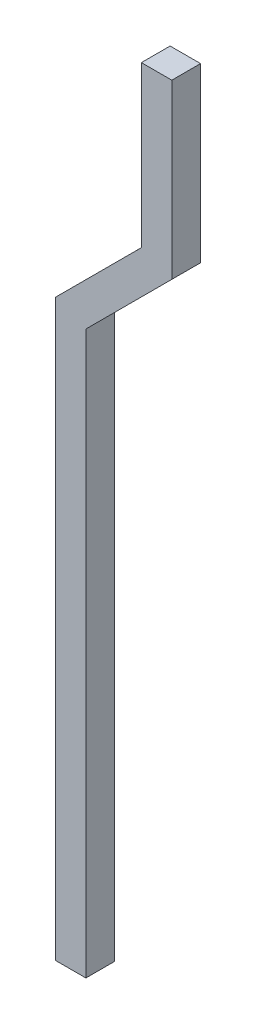
ISO-10303-21;
HEADER;
FILE_DESCRIPTION(('STEP AP214'),'2;1');
FILE_NAME('part.step','',(''),(''),'','','');
FILE_SCHEMA(('AUTOMOTIVE_DESIGN { 1 0 10303 214 1 1 1 1 }'));
ENDSEC;
DATA;
#1=APPLICATION_CONTEXT('core data for automotive mechanical design processes');
#2=APPLICATION_PROTOCOL_DEFINITION('international standard','automotive_design',2000,#1);
#3=PRODUCT_CONTEXT('',#1,'mechanical');
#4=PRODUCT('Part','Part','',(#3));
#5=PRODUCT_RELATED_PRODUCT_CATEGORY('part','',(#4));
#6=PRODUCT_DEFINITION_FORMATION('','',#4);
#7=PRODUCT_DEFINITION_CONTEXT('part definition',#1,'design');
#8=PRODUCT_DEFINITION('design','',#6,#7);
#9=PRODUCT_DEFINITION_SHAPE('','',#8);
#10=(LENGTH_UNIT() NAMED_UNIT(*) SI_UNIT(.MILLI.,.METRE.));
#11=(NAMED_UNIT(*) PLANE_ANGLE_UNIT() SI_UNIT($,.RADIAN.));
#12=(NAMED_UNIT(*) SI_UNIT($,.STERADIAN.) SOLID_ANGLE_UNIT());
#13=UNCERTAINTY_MEASURE_WITH_UNIT(LENGTH_MEASURE(1.E-05),#10,'distance_accuracy_value','');
#14=(GEOMETRIC_REPRESENTATION_CONTEXT(3) GLOBAL_UNCERTAINTY_ASSIGNED_CONTEXT((#13)) GLOBAL_UNIT_ASSIGNED_CONTEXT((#10,
#11,#12)) REPRESENTATION_CONTEXT('',''));
#15=CARTESIAN_POINT('',(0.,0.,0.));
#16=DIRECTION('',(0.,0.,1.));
#17=DIRECTION('',(1.,0.,0.));
#18=AXIS2_PLACEMENT_3D('',#15,#16,#17);
#19=CARTESIAN_POINT('',(0.42949114,6.350508,0.));
#20=DIRECTION('',(1.,0.,0.));
#21=DIRECTION('',(0.,1.,0.));
#22=AXIS2_PLACEMENT_3D('',#19,#20,#21);
#23=PLANE('',#22);
#24=CARTESIAN_POINT('',(0.42949114,3.86882386,0.));
#25=DIRECTION('',(0.,0.,1.));
#26=VECTOR('',#25,1.);
#27=LINE('',#24,#26);
#28=CARTESIAN_POINT('',(0.429092709521779,3.86921260464256,0.));
#29=VERTEX_POINT('',#28);
#30=CARTESIAN_POINT('',(0.429092709521779,3.86921260464256,0.44500038));
#31=VERTEX_POINT('',#30);
#32=EDGE_CURVE('E268',#29,#31,#27,.T.);
#33=ORIENTED_EDGE('',*,*,#32,.T.);
#34=CARTESIAN_POINT('',(0.42949114,3.8692201,0.44500038));
#35=DIRECTION('',(0.,1.,0.));
#36=VECTOR('',#35,1.);
#37=LINE('',#34,#36);
#38=CARTESIAN_POINT('',(0.42949114,6.350508,0.44500038));
#39=VERTEX_POINT('',#38);
#40=EDGE_CURVE('E88',#31,#39,#37,.T.);
#41=ORIENTED_EDGE('',*,*,#40,.T.);
#42=CARTESIAN_POINT('',(0.42949114,6.350508,0.44500038));
#43=DIRECTION('',(0.,0.,-1.));
#44=VECTOR('',#43,1.);
#45=LINE('',#42,#44);
#46=CARTESIAN_POINT('',(0.42949114,6.350508,0.));
#47=VERTEX_POINT('',#46);
#48=EDGE_CURVE('E81',#39,#47,#45,.T.);
#49=ORIENTED_EDGE('',*,*,#48,.T.);
#50=CARTESIAN_POINT('',(0.42949114,3.8692201,0.));
#51=DIRECTION('',(0.,1.,0.));
#52=VECTOR('',#51,1.);
#53=LINE('',#50,#52);
#54=EDGE_CURVE('E85',#29,#47,#53,.T.);
#55=ORIENTED_EDGE('',*,*,#54,.F.);
#56=EDGE_LOOP('',(#33,#41,#49,#55));
#57=FACE_BOUND('',#56,.T.);
#58=ADVANCED_FACE('F17',(#57),#23,.F.);
#59=CARTESIAN_POINT('',(0.90050874,6.350508,0.));
#60=DIRECTION('',(0.,-1.,0.));
#61=DIRECTION('',(0.,0.,-1.));
#62=AXIS2_PLACEMENT_3D('',#59,#60,#61);
#63=PLANE('',#62);
#64=ORIENTED_EDGE('',*,*,#48,.F.);
#65=CARTESIAN_POINT('',(0.42949114,6.350508,0.44500038));
#66=DIRECTION('',(1.,0.,0.));
#67=VECTOR('',#66,1.);
#68=LINE('',#65,#67);
#69=CARTESIAN_POINT('',(0.90050874,6.350508,0.44500038));
#70=VERTEX_POINT('',#69);
#71=EDGE_CURVE('E261',#39,#70,#68,.T.);
#72=ORIENTED_EDGE('',*,*,#71,.T.);
#73=CARTESIAN_POINT('',(0.90050874,6.350508,0.44500038));
#74=DIRECTION('',(0.,0.,-1.));
#75=VECTOR('',#74,1.);
#76=LINE('',#73,#75);
#77=CARTESIAN_POINT('',(0.90050874,6.350508,0.));
#78=VERTEX_POINT('',#77);
#79=EDGE_CURVE('E94',#70,#78,#76,.T.);
#80=ORIENTED_EDGE('',*,*,#79,.T.);
#81=CARTESIAN_POINT('',(0.42949114,6.350508,0.));
#82=DIRECTION('',(1.,0.,0.));
#83=VECTOR('',#82,1.);
#84=LINE('',#81,#83);
#85=EDGE_CURVE('E98',#47,#78,#84,.T.);
#86=ORIENTED_EDGE('',*,*,#85,.F.);
#87=EDGE_LOOP('',(#64,#72,#80,#86));
#88=FACE_BOUND('',#87,.T.);
#89=ADVANCED_FACE('F100',(#88),#63,.F.);
#90=CARTESIAN_POINT('',(0.90050874,3.67979198,0.));
#91=DIRECTION('',(-1.,0.,0.));
#92=DIRECTION('',(0.,0.,1.));
#93=AXIS2_PLACEMENT_3D('',#90,#91,#92);
#94=PLANE('',#93);
#95=ORIENTED_EDGE('',*,*,#79,.F.);
#96=CARTESIAN_POINT('',(0.90050874,6.350508,0.44500038));
#97=DIRECTION('',(0.,-1.,0.));
#98=VECTOR('',#97,1.);
#99=LINE('',#96,#98);
#100=CARTESIAN_POINT('',(0.900428729999866,3.67969292000013,0.44500038));
#101=VERTEX_POINT('',#100);
#102=EDGE_CURVE('E255',#70,#101,#99,.T.);
#103=ORIENTED_EDGE('',*,*,#102,.T.);
#104=CARTESIAN_POINT('',(0.90050874,3.67979198,0.44500038));
#105=DIRECTION('',(0.,0.,-1.));
#106=VECTOR('',#105,1.);
#107=LINE('',#104,#106);
#108=CARTESIAN_POINT('',(0.900428729999866,3.67969292000013,0.));
#109=VERTEX_POINT('',#108);
#110=EDGE_CURVE('E218',#101,#109,#107,.T.);
#111=ORIENTED_EDGE('',*,*,#110,.T.);
#112=CARTESIAN_POINT('',(0.90050874,6.350508,0.));
#113=DIRECTION('',(0.,-1.,0.));
#114=VECTOR('',#113,1.);
#115=LINE('',#112,#114);
#116=EDGE_CURVE('E108',#78,#109,#115,.T.);
#117=ORIENTED_EDGE('',*,*,#116,.F.);
#118=EDGE_LOOP('',(#95,#103,#111,#117));
#119=FACE_BOUND('',#118,.T.);
#120=ADVANCED_FACE('F214',(#119),#94,.F.);
#121=CARTESIAN_POINT('',(-0.42949114,2.3497921,0.));
#122=DIRECTION('',(-0.707096651640994,0.707116910586994,0.));
#123=DIRECTION('',(0.,0.,1.));
#124=AXIS2_PLACEMENT_3D('',#121,#122,#123);
#125=PLANE('',#124);
#126=ORIENTED_EDGE('',*,*,#110,.F.);
#127=CARTESIAN_POINT('',(0.90034871999973,3.67959386000027,0.44500038));
#128=DIRECTION('',(-0.707116910586994,-0.707096651640994,0.));
#129=VECTOR('',#128,1.);
#130=LINE('',#127,#129);
#131=CARTESIAN_POINT('',(-0.42949114,2.3497921,0.44500038));
#132=VERTEX_POINT('',#131);
#133=EDGE_CURVE('E260',#101,#132,#130,.T.);
#134=ORIENTED_EDGE('',*,*,#133,.T.);
#135=CARTESIAN_POINT('',(-0.42949114,2.3497921,0.44500038));
#136=DIRECTION('',(0.,0.,-1.));
#137=VECTOR('',#136,1.);
#138=LINE('',#135,#137);
#139=CARTESIAN_POINT('',(-0.42949114,2.3497921,0.));
#140=VERTEX_POINT('',#139);
#141=EDGE_CURVE('E118',#132,#140,#138,.T.);
#142=ORIENTED_EDGE('',*,*,#141,.T.);
#143=CARTESIAN_POINT('',(0.90034871999973,3.67959386000026,0.));
#144=DIRECTION('',(-0.707116910586997,-0.707096651640991,0.));
#145=VECTOR('',#144,1.);
#146=LINE('',#143,#145);
#147=EDGE_CURVE('E198',#109,#140,#146,.T.);
#148=ORIENTED_EDGE('',*,*,#147,.F.);
#149=EDGE_LOOP('',(#126,#134,#142,#148));
#150=FACE_BOUND('',#149,.T.);
#151=ADVANCED_FACE('F236',(#150),#125,.F.);
#152=CARTESIAN_POINT('',(0.42866564,3.86938012,0.));
#153=DIRECTION('',(0.707096645348904,-0.707116916878904,0.));
#154=DIRECTION('',(0.,0.,-1.));
#155=AXIS2_PLACEMENT_3D('',#152,#153,#154);
#156=PLANE('',#155);
#157=CARTESIAN_POINT('',(-0.900348719999954,2.54040385999996,0.));
#158=DIRECTION('',(0.,0.,1.));
#159=VECTOR('',#158,1.);
#160=LINE('',#157,#159);
#161=CARTESIAN_POINT('',(-0.900428729999978,2.54030479999998,0.));
#162=VERTEX_POINT('',#161);
#163=CARTESIAN_POINT('',(-0.900428729999978,2.54030479999998,0.44500038));
#164=VERTEX_POINT('',#163);
#165=EDGE_CURVE('E351',#162,#164,#160,.T.);
#166=ORIENTED_EDGE('',*,*,#165,.T.);
#167=CARTESIAN_POINT('',(-0.900348719999954,2.54040385999996,0.44500038));
#168=DIRECTION('',(0.707116916878904,0.707096645348904,0.));
#169=VECTOR('',#168,1.);
#170=LINE('',#167,#169);
#171=EDGE_CURVE('E340',#164,#31,#170,.T.);
#172=ORIENTED_EDGE('',*,*,#171,.T.);
#173=ORIENTED_EDGE('',*,*,#32,.F.);
#174=CARTESIAN_POINT('',(-0.900348719999955,2.54040385999996,0.));
#175=DIRECTION('',(0.707116916878905,0.707096645348902,0.));
#176=VECTOR('',#175,1.);
#177=LINE('',#174,#176);
#178=EDGE_CURVE('E115',#162,#29,#177,.T.);
#179=ORIENTED_EDGE('',*,*,#178,.F.);
#180=EDGE_LOOP('',(#166,#172,#173,#179));
#181=FACE_BOUND('',#180,.T.);
#182=ADVANCED_FACE('F385',(#181),#156,.F.);
#183=CARTESIAN_POINT('',(-0.90050874,2.54020574,0.));
#184=DIRECTION('',(1.,0.,0.));
#185=DIRECTION('',(0.,1.,0.));
#186=AXIS2_PLACEMENT_3D('',#183,#184,#185);
#187=PLANE('',#186);
#188=CARTESIAN_POINT('',(-0.90050874,-6.350508,0.));
#189=DIRECTION('',(0.,0.,1.));
#190=VECTOR('',#189,1.);
#191=LINE('',#188,#190);
#192=CARTESIAN_POINT('',(-0.90050874,-6.350508,0.));
#193=VERTEX_POINT('',#192);
#194=CARTESIAN_POINT('',(-0.90050874,-6.350508,0.44500038));
#195=VERTEX_POINT('',#194);
#196=EDGE_CURVE('E197',#193,#195,#191,.T.);
#197=ORIENTED_EDGE('',*,*,#196,.T.);
#198=CARTESIAN_POINT('',(-0.90050874,-6.350508,0.44500038));
#199=DIRECTION('',(0.,1.,0.));
#200=VECTOR('',#199,1.);
#201=LINE('',#198,#200);
#202=EDGE_CURVE('E278',#195,#164,#201,.T.);
#203=ORIENTED_EDGE('',*,*,#202,.T.);
#204=ORIENTED_EDGE('',*,*,#165,.F.);
#205=CARTESIAN_POINT('',(-0.90050874,-6.350508,0.));
#206=DIRECTION('',(0.,1.,0.));
#207=VECTOR('',#206,1.);
#208=LINE('',#205,#207);
#209=EDGE_CURVE('E178',#193,#162,#208,.T.);
#210=ORIENTED_EDGE('',*,*,#209,.F.);
#211=EDGE_LOOP('',(#197,#203,#204,#210));
#212=FACE_BOUND('',#211,.T.);
#213=ADVANCED_FACE('F294',(#212),#187,.F.);
#214=CARTESIAN_POINT('',(-0.90050874,-6.350508,0.44500038));
#215=DIRECTION('',(0.,0.,-1.));
#216=DIRECTION('',(0.,-1.,0.));
#217=AXIS2_PLACEMENT_3D('',#214,#215,#216);
#218=PLANE('',#217);
#219=ORIENTED_EDGE('',*,*,#202,.F.);
#220=CARTESIAN_POINT('',(-0.90050874,-6.350508,0.44500038));
#221=DIRECTION('',(1.,0.,0.));
#222=VECTOR('',#221,1.);
#223=LINE('',#220,#222);
#224=CARTESIAN_POINT('',(-0.42949114,-6.350508,0.44500038));
#225=VERTEX_POINT('',#224);
#226=EDGE_CURVE('E470',#195,#225,#223,.T.);
#227=ORIENTED_EDGE('',*,*,#226,.T.);
#228=CARTESIAN_POINT('',(-0.42949114,-6.350508,0.44500038));
#229=DIRECTION('',(0.,1.,0.));
#230=VECTOR('',#229,1.);
#231=LINE('',#228,#230);
#232=EDGE_CURVE('E274',#225,#132,#231,.T.);
#233=ORIENTED_EDGE('',*,*,#232,.T.);
#234=ORIENTED_EDGE('',*,*,#133,.F.);
#235=ORIENTED_EDGE('',*,*,#102,.F.);
#236=ORIENTED_EDGE('',*,*,#71,.F.);
#237=ORIENTED_EDGE('',*,*,#40,.F.);
#238=ORIENTED_EDGE('',*,*,#171,.F.);
#239=EDGE_LOOP('',(#219,#227,#233,#234,#235,#236,#237,#238));
#240=FACE_BOUND('',#239,.T.);
#241=ADVANCED_FACE('F273',(#240),#218,.F.);
#242=CARTESIAN_POINT('',(-0.42949114,-6.350508,0.));
#243=DIRECTION('',(-1.,0.,0.));
#244=DIRECTION('',(0.,0.,1.));
#245=AXIS2_PLACEMENT_3D('',#242,#243,#244);
#246=PLANE('',#245);
#247=ORIENTED_EDGE('',*,*,#141,.F.);
#248=ORIENTED_EDGE('',*,*,#232,.F.);
#249=CARTESIAN_POINT('',(-0.42949114,-6.350508,0.44500038));
#250=DIRECTION('',(0.,0.,-1.));
#251=VECTOR('',#250,1.);
#252=LINE('',#249,#251);
#253=CARTESIAN_POINT('',(-0.42949114,-6.350508,0.));
#254=VERTEX_POINT('',#253);
#255=EDGE_CURVE('E29',#225,#254,#252,.T.);
#256=ORIENTED_EDGE('',*,*,#255,.T.);
#257=CARTESIAN_POINT('',(-0.42949114,2.3497921,0.));
#258=DIRECTION('',(0.,-1.,0.));
#259=VECTOR('',#258,1.);
#260=LINE('',#257,#259);
#261=EDGE_CURVE('E191',#140,#254,#260,.T.);
#262=ORIENTED_EDGE('',*,*,#261,.F.);
#263=EDGE_LOOP('',(#247,#248,#256,#262));
#264=FACE_BOUND('',#263,.T.);
#265=ADVANCED_FACE('F138',(#264),#246,.F.);
#266=CARTESIAN_POINT('',(-0.90050874,-6.350508,0.));
#267=DIRECTION('',(0.,0.,-1.));
#268=DIRECTION('',(0.,-1.,0.));
#269=AXIS2_PLACEMENT_3D('',#266,#267,#268);
#270=PLANE('',#269);
#271=ORIENTED_EDGE('',*,*,#209,.T.);
#272=ORIENTED_EDGE('',*,*,#178,.T.);
#273=ORIENTED_EDGE('',*,*,#54,.T.);
#274=ORIENTED_EDGE('',*,*,#85,.T.);
#275=ORIENTED_EDGE('',*,*,#116,.T.);
#276=ORIENTED_EDGE('',*,*,#147,.T.);
#277=ORIENTED_EDGE('',*,*,#261,.T.);
#278=CARTESIAN_POINT('',(-0.42949114,-6.350508,0.));
#279=DIRECTION('',(-1.,0.,0.));
#280=VECTOR('',#279,1.);
#281=LINE('',#278,#280);
#282=EDGE_CURVE('E11',#254,#193,#281,.T.);
#283=ORIENTED_EDGE('',*,*,#282,.T.);
#284=EDGE_LOOP('',(#271,#272,#273,#274,#275,#276,#277,#283));
#285=FACE_BOUND('',#284,.T.);
#286=ADVANCED_FACE('F113',(#285),#270,.T.);
#287=CARTESIAN_POINT('',(-0.90050874,-6.350508,0.));
#288=DIRECTION('',(0.,1.,0.));
#289=DIRECTION('',(1.,0.,0.));
#290=AXIS2_PLACEMENT_3D('',#287,#288,#289);
#291=PLANE('',#290);
#292=ORIENTED_EDGE('',*,*,#255,.F.);
#293=ORIENTED_EDGE('',*,*,#226,.F.);
#294=ORIENTED_EDGE('',*,*,#196,.F.);
#295=ORIENTED_EDGE('',*,*,#282,.F.);
#296=EDGE_LOOP('',(#292,#293,#294,#295));
#297=FACE_BOUND('',#296,.T.);
#298=ADVANCED_FACE('F137',(#297),#291,.F.);
#299=CLOSED_SHELL('',(#58,#89,#120,#151,#182,#213,#241,#265,#286,#298));
#300=MANIFOLD_SOLID_BREP('B1',#299);
#301=ADVANCED_BREP_SHAPE_REPRESENTATION('',(#18,#300),#14);
#302=SHAPE_DEFINITION_REPRESENTATION(#9,#301);
ENDSEC;
END-ISO-10303-21;
